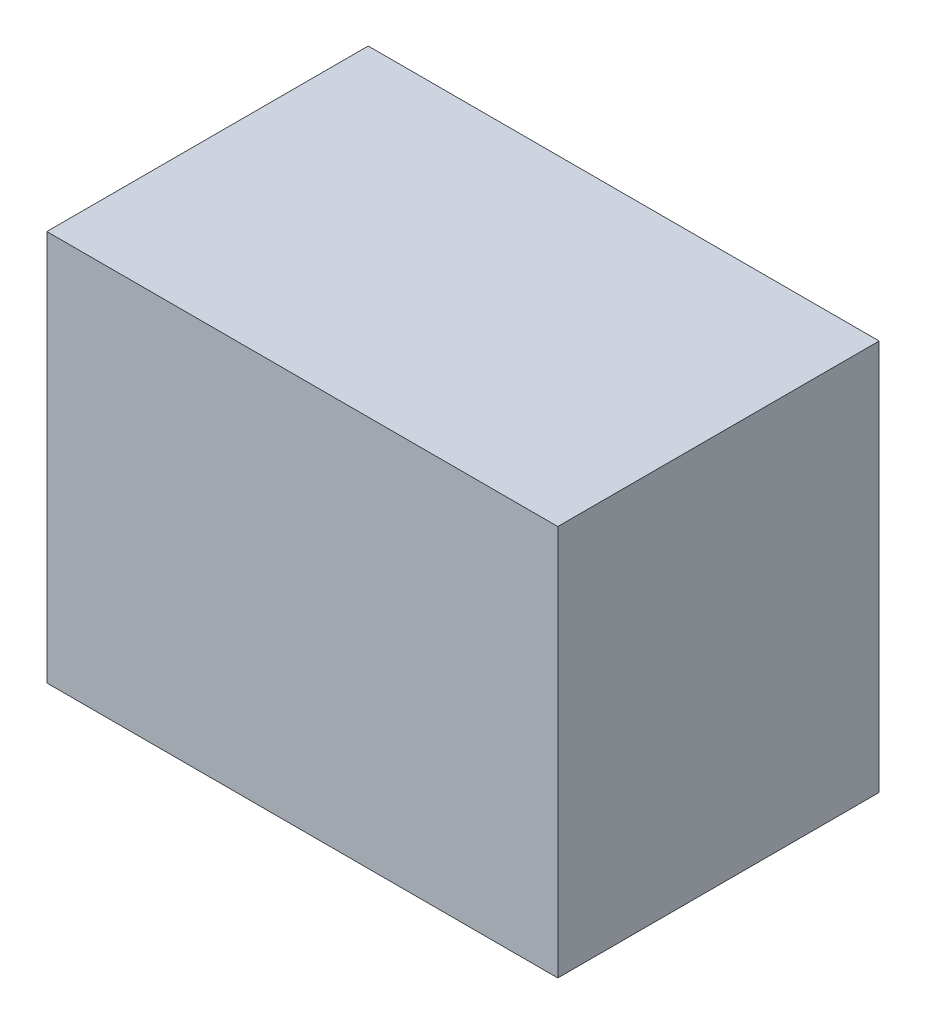
ISO-10303-21;
HEADER;
FILE_DESCRIPTION(('STEP AP214'),'2;1');
FILE_NAME('part.step','',(''),(''),'','','');
FILE_SCHEMA(('AUTOMOTIVE_DESIGN { 1 0 10303 214 1 1 1 1 }'));
ENDSEC;
DATA;
#1=APPLICATION_CONTEXT('core data for automotive mechanical design processes');
#2=APPLICATION_PROTOCOL_DEFINITION('international standard','automotive_design',2000,#1);
#3=PRODUCT_CONTEXT('',#1,'mechanical');
#4=PRODUCT('Part','Part','',(#3));
#5=PRODUCT_RELATED_PRODUCT_CATEGORY('part','',(#4));
#6=PRODUCT_DEFINITION_FORMATION('','',#4);
#7=PRODUCT_DEFINITION_CONTEXT('part definition',#1,'design');
#8=PRODUCT_DEFINITION('design','',#6,#7);
#9=PRODUCT_DEFINITION_SHAPE('','',#8);
#10=(LENGTH_UNIT() NAMED_UNIT(*) SI_UNIT(.MILLI.,.METRE.));
#11=(NAMED_UNIT(*) PLANE_ANGLE_UNIT() SI_UNIT($,.RADIAN.));
#12=(NAMED_UNIT(*) SI_UNIT($,.STERADIAN.) SOLID_ANGLE_UNIT());
#13=UNCERTAINTY_MEASURE_WITH_UNIT(LENGTH_MEASURE(1.E-05),#10,'distance_accuracy_value','');
#14=(GEOMETRIC_REPRESENTATION_CONTEXT(3) GLOBAL_UNCERTAINTY_ASSIGNED_CONTEXT((#13)) GLOBAL_UNIT_ASSIGNED_CONTEXT((#10,
#11,#12)) REPRESENTATION_CONTEXT('',''));
#15=CARTESIAN_POINT('',(0.,0.,0.));
#16=DIRECTION('',(0.,0.,1.));
#17=DIRECTION('',(1.,0.,0.));
#18=AXIS2_PLACEMENT_3D('',#15,#16,#17);
#19=CARTESIAN_POINT('',(0.,10.95,0.));
#20=DIRECTION('',(1.,0.,0.));
#21=DIRECTION('',(0.,0.,-1.));
#22=AXIS2_PLACEMENT_3D('',#19,#20,#21);
#23=PLANE('',#22);
#24=DIRECTION('',(0.,0.,1.));
#25=VECTOR('',#24,1.);
#26=CARTESIAN_POINT('',(0.,0.,0.));
#27=LINE('',#26,#25);
#28=CARTESIAN_POINT('',(0.,0.,-9.));
#29=VERTEX_POINT('',#28);
#30=CARTESIAN_POINT('',(0.,0.,0.));
#31=VERTEX_POINT('',#30);
#32=EDGE_CURVE('E96',#29,#31,#27,.T.);
#33=ORIENTED_EDGE('',*,*,#32,.T.);
#34=DIRECTION('',(0.,-1.,0.));
#35=VECTOR('',#34,1.);
#36=CARTESIAN_POINT('',(0.,10.95,0.));
#37=LINE('',#36,#35);
#38=CARTESIAN_POINT('',(0.,10.95,0.));
#39=VERTEX_POINT('',#38);
#40=EDGE_CURVE('E11',#39,#31,#37,.T.);
#41=ORIENTED_EDGE('',*,*,#40,.F.);
#42=DIRECTION('',(0.,0.,1.));
#43=VECTOR('',#42,1.);
#44=CARTESIAN_POINT('',(0.,10.95,0.));
#45=LINE('',#44,#43);
#46=CARTESIAN_POINT('',(0.,10.95,-9.));
#47=VERTEX_POINT('',#46);
#48=EDGE_CURVE('E84',#47,#39,#45,.T.);
#49=ORIENTED_EDGE('',*,*,#48,.F.);
#50=DIRECTION('',(0.,-1.,0.));
#51=VECTOR('',#50,1.);
#52=CARTESIAN_POINT('',(0.,10.95,-9.));
#53=LINE('',#52,#51);
#54=EDGE_CURVE('E92',#47,#29,#53,.T.);
#55=ORIENTED_EDGE('',*,*,#54,.T.);
#56=EDGE_LOOP('',(#33,#41,#49,#55));
#57=FACE_BOUND('',#56,.T.);
#58=ADVANCED_FACE('F33',(#57),#23,.F.);
#59=CARTESIAN_POINT('',(0.,10.95,0.));
#60=DIRECTION('',(0.,0.,-1.));
#61=DIRECTION('',(-1.,0.,0.));
#62=AXIS2_PLACEMENT_3D('',#59,#60,#61);
#63=PLANE('',#62);
#64=DIRECTION('',(1.,0.,0.));
#65=VECTOR('',#64,1.);
#66=CARTESIAN_POINT('',(0.,0.,0.));
#67=LINE('',#66,#65);
#68=CARTESIAN_POINT('',(14.31,0.,0.));
#69=VERTEX_POINT('',#68);
#70=EDGE_CURVE('E88',#31,#69,#67,.T.);
#71=ORIENTED_EDGE('',*,*,#70,.T.);
#72=DIRECTION('',(0.,-1.,0.));
#73=VECTOR('',#72,1.);
#74=CARTESIAN_POINT('',(14.31,10.95,0.));
#75=LINE('',#74,#73);
#76=CARTESIAN_POINT('',(14.31,10.95,0.));
#77=VERTEX_POINT('',#76);
#78=EDGE_CURVE('E41',#77,#69,#75,.T.);
#79=ORIENTED_EDGE('',*,*,#78,.F.);
#80=DIRECTION('',(1.,0.,0.));
#81=VECTOR('',#80,1.);
#82=CARTESIAN_POINT('',(0.,10.95,0.));
#83=LINE('',#82,#81);
#84=EDGE_CURVE('E79',#39,#77,#83,.T.);
#85=ORIENTED_EDGE('',*,*,#84,.F.);
#86=ORIENTED_EDGE('',*,*,#40,.T.);
#87=EDGE_LOOP('',(#71,#79,#85,#86));
#88=FACE_BOUND('',#87,.T.);
#89=ADVANCED_FACE('F87',(#88),#63,.F.);
#90=CARTESIAN_POINT('',(14.31,10.95,0.));
#91=DIRECTION('',(-1.,0.,0.));
#92=DIRECTION('',(0.,0.,1.));
#93=AXIS2_PLACEMENT_3D('',#90,#91,#92);
#94=PLANE('',#93);
#95=DIRECTION('',(0.,0.,-1.));
#96=VECTOR('',#95,1.);
#97=CARTESIAN_POINT('',(14.31,0.,0.));
#98=LINE('',#97,#96);
#99=CARTESIAN_POINT('',(14.31,0.,-9.));
#100=VERTEX_POINT('',#99);
#101=EDGE_CURVE('E66',#69,#100,#98,.T.);
#102=ORIENTED_EDGE('',*,*,#101,.T.);
#103=DIRECTION('',(0.,-1.,0.));
#104=VECTOR('',#103,1.);
#105=CARTESIAN_POINT('',(14.31,10.95,-9.));
#106=LINE('',#105,#104);
#107=CARTESIAN_POINT('',(14.31,10.95,-9.));
#108=VERTEX_POINT('',#107);
#109=EDGE_CURVE('E89',#108,#100,#106,.T.);
#110=ORIENTED_EDGE('',*,*,#109,.F.);
#111=DIRECTION('',(0.,0.,-1.));
#112=VECTOR('',#111,1.);
#113=CARTESIAN_POINT('',(14.31,10.95,0.));
#114=LINE('',#113,#112);
#115=EDGE_CURVE('E82',#77,#108,#114,.T.);
#116=ORIENTED_EDGE('',*,*,#115,.F.);
#117=ORIENTED_EDGE('',*,*,#78,.T.);
#118=EDGE_LOOP('',(#102,#110,#116,#117));
#119=FACE_BOUND('',#118,.T.);
#120=ADVANCED_FACE('F90',(#119),#94,.F.);
#121=CARTESIAN_POINT('',(0.,10.95,-9.));
#122=DIRECTION('',(0.,0.,1.));
#123=DIRECTION('',(1.,0.,0.));
#124=AXIS2_PLACEMENT_3D('',#121,#122,#123);
#125=PLANE('',#124);
#126=DIRECTION('',(-1.,0.,0.));
#127=VECTOR('',#126,1.);
#128=CARTESIAN_POINT('',(0.,0.,-9.));
#129=LINE('',#128,#127);
#130=EDGE_CURVE('E72',#100,#29,#129,.T.);
#131=ORIENTED_EDGE('',*,*,#130,.T.);
#132=ORIENTED_EDGE('',*,*,#54,.F.);
#133=DIRECTION('',(-1.,0.,0.));
#134=VECTOR('',#133,1.);
#135=CARTESIAN_POINT('',(0.,10.95,-9.));
#136=LINE('',#135,#134);
#137=EDGE_CURVE('E49',#108,#47,#136,.T.);
#138=ORIENTED_EDGE('',*,*,#137,.F.);
#139=ORIENTED_EDGE('',*,*,#109,.T.);
#140=EDGE_LOOP('',(#131,#132,#138,#139));
#141=FACE_BOUND('',#140,.T.);
#142=ADVANCED_FACE('F103',(#141),#125,.F.);
#143=CARTESIAN_POINT('',(0.,10.95,0.));
#144=DIRECTION('',(0.,-1.,0.));
#145=DIRECTION('',(0.,0.,-1.));
#146=AXIS2_PLACEMENT_3D('',#143,#144,#145);
#147=PLANE('',#146);
#148=ORIENTED_EDGE('',*,*,#48,.T.);
#149=ORIENTED_EDGE('',*,*,#84,.T.);
#150=ORIENTED_EDGE('',*,*,#115,.T.);
#151=ORIENTED_EDGE('',*,*,#137,.T.);
#152=EDGE_LOOP('',(#148,#149,#150,#151));
#153=FACE_BOUND('',#152,.T.);
#154=ADVANCED_FACE('F80',(#153),#147,.F.);
#155=CARTESIAN_POINT('',(0.,0.,0.));
#156=DIRECTION('',(0.,-1.,0.));
#157=DIRECTION('',(0.,0.,-1.));
#158=AXIS2_PLACEMENT_3D('',#155,#156,#157);
#159=PLANE('',#158);
#160=ORIENTED_EDGE('',*,*,#32,.F.);
#161=ORIENTED_EDGE('',*,*,#130,.F.);
#162=ORIENTED_EDGE('',*,*,#101,.F.);
#163=ORIENTED_EDGE('',*,*,#70,.F.);
#164=EDGE_LOOP('',(#160,#161,#162,#163));
#165=FACE_BOUND('',#164,.T.);
#166=ADVANCED_FACE('F106',(#165),#159,.T.);
#167=CLOSED_SHELL('',(#58,#89,#120,#142,#154,#166));
#168=MANIFOLD_SOLID_BREP('B2',#167);
#169=ADVANCED_BREP_SHAPE_REPRESENTATION('',(#18,#168),#14);
#170=SHAPE_DEFINITION_REPRESENTATION(#9,#169);
ENDSEC;
END-ISO-10303-21;
